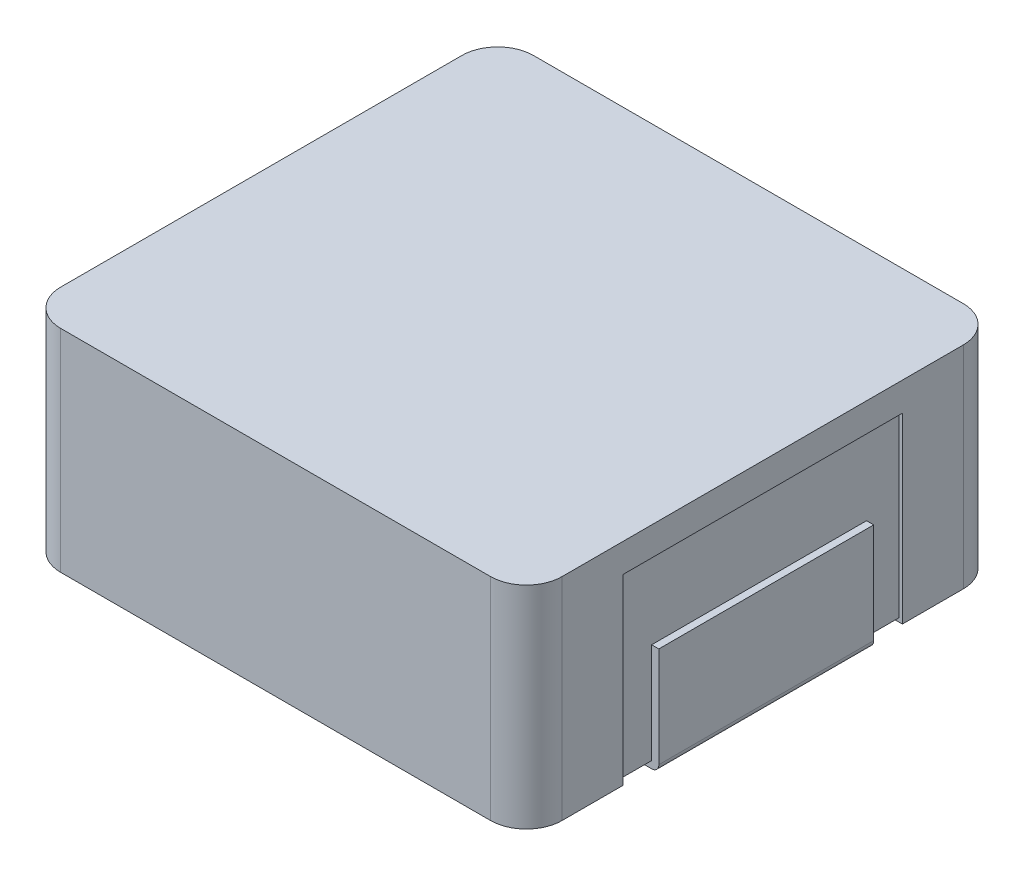
ISO-10303-21;
HEADER;
FILE_DESCRIPTION(('STEP AP214'),'2;1');
FILE_NAME('part.step','',(''),(''),'','','');
FILE_SCHEMA(('AUTOMOTIVE_DESIGN { 1 0 10303 214 1 1 1 1 }'));
ENDSEC;
DATA;
#1=APPLICATION_CONTEXT('core data for automotive mechanical design processes');
#2=APPLICATION_PROTOCOL_DEFINITION('international standard','automotive_design',2000,#1);
#3=PRODUCT_CONTEXT('',#1,'mechanical');
#4=PRODUCT('Part','Part','',(#3));
#5=PRODUCT_RELATED_PRODUCT_CATEGORY('part','',(#4));
#6=PRODUCT_DEFINITION_FORMATION('','',#4);
#7=PRODUCT_DEFINITION_CONTEXT('part definition',#1,'design');
#8=PRODUCT_DEFINITION('design','',#6,#7);
#9=PRODUCT_DEFINITION_SHAPE('','',#8);
#10=(LENGTH_UNIT() NAMED_UNIT(*) SI_UNIT(.MILLI.,.METRE.));
#11=(NAMED_UNIT(*) PLANE_ANGLE_UNIT() SI_UNIT($,.RADIAN.));
#12=(NAMED_UNIT(*) SI_UNIT($,.STERADIAN.) SOLID_ANGLE_UNIT());
#13=UNCERTAINTY_MEASURE_WITH_UNIT(LENGTH_MEASURE(1.E-05),#10,'distance_accuracy_value','');
#14=(GEOMETRIC_REPRESENTATION_CONTEXT(3) GLOBAL_UNCERTAINTY_ASSIGNED_CONTEXT((#13)) GLOBAL_UNIT_ASSIGNED_CONTEXT((#10,
#11,#12)) REPRESENTATION_CONTEXT('',''));
#15=CARTESIAN_POINT('',(0.,0.,0.));
#16=DIRECTION('',(0.,0.,1.));
#17=DIRECTION('',(1.,0.,0.));
#18=AXIS2_PLACEMENT_3D('',#15,#16,#17);
#19=CARTESIAN_POINT('',(-3.45,0.05,1.5));
#20=DIRECTION('',(0.,1.,0.));
#21=DIRECTION('',(-1.,0.,0.));
#22=AXIS2_PLACEMENT_3D('',#19,#20,#21);
#23=PLANE('',#22);
#24=DIRECTION('',(1.,0.,0.));
#25=VECTOR('',#24,1.);
#26=CARTESIAN_POINT('',(-3.45,0.05,-1.5));
#27=LINE('',#26,#25);
#28=CARTESIAN_POINT('',(-3.45,0.05,-1.5));
#29=VERTEX_POINT('',#28);
#30=CARTESIAN_POINT('',(-2.05,0.0500000000000001,-1.5));
#31=VERTEX_POINT('',#30);
#32=EDGE_CURVE('E160',#29,#31,#27,.T.);
#33=ORIENTED_EDGE('',*,*,#32,.F.);
#34=DIRECTION('',(0.,0.,-1.));
#35=VECTOR('',#34,1.);
#36=CARTESIAN_POINT('',(-3.45,0.05,1.5));
#37=LINE('',#36,#35);
#38=CARTESIAN_POINT('',(-3.45,0.05,1.5));
#39=VERTEX_POINT('',#38);
#40=EDGE_CURVE('E12',#39,#29,#37,.T.);
#41=ORIENTED_EDGE('',*,*,#40,.F.);
#42=DIRECTION('',(1.,0.,0.));
#43=VECTOR('',#42,1.);
#44=CARTESIAN_POINT('',(-3.45,0.05,1.5));
#45=LINE('',#44,#43);
#46=CARTESIAN_POINT('',(-2.05,0.0500000000000001,1.5));
#47=VERTEX_POINT('',#46);
#48=EDGE_CURVE('E184',#39,#47,#45,.T.);
#49=ORIENTED_EDGE('',*,*,#48,.T.);
#50=DIRECTION('',(0.,0.,-1.));
#51=VECTOR('',#50,1.);
#52=CARTESIAN_POINT('',(-2.05,0.0500000000000001,1.5));
#53=LINE('',#52,#51);
#54=EDGE_CURVE('E64',#47,#31,#53,.T.);
#55=ORIENTED_EDGE('',*,*,#54,.T.);
#56=EDGE_LOOP('',(#33,#41,#49,#55));
#57=FACE_BOUND('',#56,.T.);
#58=ADVANCED_FACE('F61',(#57),#23,.T.);
#59=CARTESIAN_POINT('',(-3.45,1.45,1.5));
#60=DIRECTION('',(1.,0.,0.));
#61=DIRECTION('',(0.,0.,-1.));
#62=AXIS2_PLACEMENT_3D('',#59,#60,#61);
#63=PLANE('',#62);
#64=DIRECTION('',(0.,-1.,0.));
#65=VECTOR('',#64,1.);
#66=CARTESIAN_POINT('',(-3.45,1.45,-1.5));
#67=LINE('',#66,#65);
#68=CARTESIAN_POINT('',(-3.45,1.45,-1.5));
#69=VERTEX_POINT('',#68);
#70=EDGE_CURVE('E181',#69,#29,#67,.T.);
#71=ORIENTED_EDGE('',*,*,#70,.F.);
#72=DIRECTION('',(0.,0.,-1.));
#73=VECTOR('',#72,1.);
#74=CARTESIAN_POINT('',(-3.45,1.45,1.5));
#75=LINE('',#74,#73);
#76=CARTESIAN_POINT('',(-3.45,1.45,1.5));
#77=VERTEX_POINT('',#76);
#78=EDGE_CURVE('E71',#77,#69,#75,.T.);
#79=ORIENTED_EDGE('',*,*,#78,.F.);
#80=DIRECTION('',(0.,-1.,0.));
#81=VECTOR('',#80,1.);
#82=CARTESIAN_POINT('',(-3.45,1.45,1.5));
#83=LINE('',#82,#81);
#84=EDGE_CURVE('E144',#77,#39,#83,.T.);
#85=ORIENTED_EDGE('',*,*,#84,.T.);
#86=ORIENTED_EDGE('',*,*,#40,.T.);
#87=EDGE_LOOP('',(#71,#79,#85,#86));
#88=FACE_BOUND('',#87,.T.);
#89=ADVANCED_FACE('F198',(#88),#63,.T.);
#90=CARTESIAN_POINT('',(-3.55,1.45,1.5));
#91=DIRECTION('',(0.,1.,0.));
#92=DIRECTION('',(0.,0.,1.));
#93=AXIS2_PLACEMENT_3D('',#90,#91,#92);
#94=PLANE('',#93);
#95=DIRECTION('',(1.,0.,0.));
#96=VECTOR('',#95,1.);
#97=CARTESIAN_POINT('',(-3.55,1.45,-1.5));
#98=LINE('',#97,#96);
#99=CARTESIAN_POINT('',(-3.55,1.45,-1.5));
#100=VERTEX_POINT('',#99);
#101=EDGE_CURVE('E130',#100,#69,#98,.T.);
#102=ORIENTED_EDGE('',*,*,#101,.F.);
#103=DIRECTION('',(0.,0.,-1.));
#104=VECTOR('',#103,1.);
#105=CARTESIAN_POINT('',(-3.55,1.45,1.5));
#106=LINE('',#105,#104);
#107=CARTESIAN_POINT('',(-3.55,1.45,1.5));
#108=VERTEX_POINT('',#107);
#109=EDGE_CURVE('E125',#108,#100,#106,.T.);
#110=ORIENTED_EDGE('',*,*,#109,.F.);
#111=DIRECTION('',(1.,0.,0.));
#112=VECTOR('',#111,1.);
#113=CARTESIAN_POINT('',(-3.55,1.45,1.5));
#114=LINE('',#113,#112);
#115=EDGE_CURVE('E128',#108,#77,#114,.T.);
#116=ORIENTED_EDGE('',*,*,#115,.T.);
#117=ORIENTED_EDGE('',*,*,#78,.T.);
#118=EDGE_LOOP('',(#102,#110,#116,#117));
#119=FACE_BOUND('',#118,.T.);
#120=ADVANCED_FACE('F127',(#119),#94,.T.);
#121=CARTESIAN_POINT('',(-3.55,0.0500000000000009,1.5));
#122=DIRECTION('',(-1.,0.,0.));
#123=DIRECTION('',(0.,-1.,0.));
#124=AXIS2_PLACEMENT_3D('',#121,#122,#123);
#125=PLANE('',#124);
#126=DIRECTION('',(0.,1.,0.));
#127=VECTOR('',#126,1.);
#128=CARTESIAN_POINT('',(-3.55,0.0500000000000009,-1.5));
#129=LINE('',#128,#127);
#130=CARTESIAN_POINT('',(-3.55,0.0500000000000005,-1.5));
#131=VERTEX_POINT('',#130);
#132=EDGE_CURVE('E176',#131,#100,#129,.T.);
#133=ORIENTED_EDGE('',*,*,#132,.F.);
#134=DIRECTION('',(0.,0.,-1.));
#135=VECTOR('',#134,1.);
#136=CARTESIAN_POINT('',(-3.55,0.0500000000000005,1.5));
#137=LINE('',#136,#135);
#138=CARTESIAN_POINT('',(-3.55,0.0500000000000005,1.5));
#139=VERTEX_POINT('',#138);
#140=EDGE_CURVE('E136',#139,#131,#137,.T.);
#141=ORIENTED_EDGE('',*,*,#140,.F.);
#142=DIRECTION('',(0.,1.,0.));
#143=VECTOR('',#142,1.);
#144=CARTESIAN_POINT('',(-3.55,0.0500000000000009,1.5));
#145=LINE('',#144,#143);
#146=EDGE_CURVE('E142',#139,#108,#145,.T.);
#147=ORIENTED_EDGE('',*,*,#146,.T.);
#148=ORIENTED_EDGE('',*,*,#109,.T.);
#149=EDGE_LOOP('',(#133,#141,#147,#148));
#150=FACE_BOUND('',#149,.T.);
#151=ADVANCED_FACE('F147',(#150),#125,.T.);
#152=CARTESIAN_POINT('',(-3.45,0.0500000000000005,1.5));
#153=DIRECTION('',(0.,0.,-1.));
#154=DIRECTION('',(-1.,0.,0.));
#155=AXIS2_PLACEMENT_3D('',#152,#153,#154);
#156=CYLINDRICAL_SURFACE('',#155,0.0999999999999999);
#157=CARTESIAN_POINT('',(-3.45,0.0500000000000005,-1.5));
#158=DIRECTION('',(0.,0.,-1.));
#159=DIRECTION('',(-1.,0.,0.));
#160=AXIS2_PLACEMENT_3D('',#157,#158,#159);
#161=CIRCLE('',#160,0.0999999999999999);
#162=CARTESIAN_POINT('',(-3.45,-0.0499999999999995,-1.5));
#163=VERTEX_POINT('',#162);
#164=EDGE_CURVE('E172',#163,#131,#161,.T.);
#165=ORIENTED_EDGE('',*,*,#164,.F.);
#166=DIRECTION('',(0.,0.,-1.));
#167=VECTOR('',#166,1.);
#168=CARTESIAN_POINT('',(-3.45,-0.0499999999999995,1.5));
#169=LINE('',#168,#167);
#170=CARTESIAN_POINT('',(-3.45,-0.0499999999999995,1.5));
#171=VERTEX_POINT('',#170);
#172=EDGE_CURVE('E190',#171,#163,#169,.T.);
#173=ORIENTED_EDGE('',*,*,#172,.F.);
#174=CARTESIAN_POINT('',(-3.45,0.0500000000000005,1.5));
#175=DIRECTION('',(0.,0.,-1.));
#176=DIRECTION('',(-1.,0.,0.));
#177=AXIS2_PLACEMENT_3D('',#174,#175,#176);
#178=CIRCLE('',#177,0.0999999999999999);
#179=EDGE_CURVE('E149',#171,#139,#178,.T.);
#180=ORIENTED_EDGE('',*,*,#179,.T.);
#181=ORIENTED_EDGE('',*,*,#140,.T.);
#182=EDGE_LOOP('',(#165,#173,#180,#181));
#183=FACE_BOUND('',#182,.T.);
#184=ADVANCED_FACE('F211',(#183),#156,.T.);
#185=CARTESIAN_POINT('',(-2.05,-0.0499999999999999,1.5));
#186=DIRECTION('',(0.,-1.,0.));
#187=DIRECTION('',(1.,0.,0.));
#188=AXIS2_PLACEMENT_3D('',#185,#186,#187);
#189=PLANE('',#188);
#190=DIRECTION('',(-1.,0.,0.));
#191=VECTOR('',#190,1.);
#192=CARTESIAN_POINT('',(-2.05,-0.0499999999999999,-1.5));
#193=LINE('',#192,#191);
#194=CARTESIAN_POINT('',(-2.05,-0.0499999999999999,-1.5));
#195=VERTEX_POINT('',#194);
#196=EDGE_CURVE('E168',#195,#163,#193,.T.);
#197=ORIENTED_EDGE('',*,*,#196,.F.);
#198=DIRECTION('',(0.,0.,-1.));
#199=VECTOR('',#198,1.);
#200=CARTESIAN_POINT('',(-2.05,-0.0499999999999999,1.5));
#201=LINE('',#200,#199);
#202=CARTESIAN_POINT('',(-2.05,-0.0499999999999999,1.5));
#203=VERTEX_POINT('',#202);
#204=EDGE_CURVE('E192',#203,#195,#201,.T.);
#205=ORIENTED_EDGE('',*,*,#204,.F.);
#206=DIRECTION('',(-1.,0.,0.));
#207=VECTOR('',#206,1.);
#208=CARTESIAN_POINT('',(-2.05,-0.0499999999999999,1.5));
#209=LINE('',#208,#207);
#210=EDGE_CURVE('E154',#203,#171,#209,.T.);
#211=ORIENTED_EDGE('',*,*,#210,.T.);
#212=ORIENTED_EDGE('',*,*,#172,.T.);
#213=EDGE_LOOP('',(#197,#205,#211,#212));
#214=FACE_BOUND('',#213,.T.);
#215=ADVANCED_FACE('F214',(#214),#189,.T.);
#216=CARTESIAN_POINT('',(-2.05,0.0500000000000001,1.5));
#217=DIRECTION('',(1.,0.,0.));
#218=DIRECTION('',(0.,0.,-1.));
#219=AXIS2_PLACEMENT_3D('',#216,#217,#218);
#220=PLANE('',#219);
#221=DIRECTION('',(0.,-1.,0.));
#222=VECTOR('',#221,1.);
#223=CARTESIAN_POINT('',(-2.05,0.0500000000000001,-1.5));
#224=LINE('',#223,#222);
#225=EDGE_CURVE('E164',#31,#195,#224,.T.);
#226=ORIENTED_EDGE('',*,*,#225,.F.);
#227=ORIENTED_EDGE('',*,*,#54,.F.);
#228=DIRECTION('',(0.,-1.,0.));
#229=VECTOR('',#228,1.);
#230=CARTESIAN_POINT('',(-2.05,0.0500000000000001,1.5));
#231=LINE('',#230,#229);
#232=EDGE_CURVE('E322',#47,#203,#231,.T.);
#233=ORIENTED_EDGE('',*,*,#232,.T.);
#234=ORIENTED_EDGE('',*,*,#204,.T.);
#235=EDGE_LOOP('',(#226,#227,#233,#234));
#236=FACE_BOUND('',#235,.T.);
#237=ADVANCED_FACE('F195',(#236),#220,.T.);
#238=CARTESIAN_POINT('',(-3.45,0.0500000000000005,1.5));
#239=DIRECTION('',(0.,0.,-1.));
#240=DIRECTION('',(-1.,0.,0.));
#241=AXIS2_PLACEMENT_3D('',#238,#239,#240);
#242=PLANE('',#241);
#243=ORIENTED_EDGE('',*,*,#48,.F.);
#244=ORIENTED_EDGE('',*,*,#84,.F.);
#245=ORIENTED_EDGE('',*,*,#115,.F.);
#246=ORIENTED_EDGE('',*,*,#146,.F.);
#247=ORIENTED_EDGE('',*,*,#179,.F.);
#248=ORIENTED_EDGE('',*,*,#210,.F.);
#249=ORIENTED_EDGE('',*,*,#232,.F.);
#250=EDGE_LOOP('',(#243,#244,#245,#246,#247,#248,#249));
#251=FACE_BOUND('',#250,.T.);
#252=ADVANCED_FACE('F140',(#251),#242,.F.);
#253=CARTESIAN_POINT('',(-3.45,0.0500000000000005,-1.5));
#254=DIRECTION('',(0.,0.,-1.));
#255=DIRECTION('',(-1.,0.,0.));
#256=AXIS2_PLACEMENT_3D('',#253,#254,#255);
#257=PLANE('',#256);
#258=ORIENTED_EDGE('',*,*,#32,.T.);
#259=ORIENTED_EDGE('',*,*,#225,.T.);
#260=ORIENTED_EDGE('',*,*,#196,.T.);
#261=ORIENTED_EDGE('',*,*,#164,.T.);
#262=ORIENTED_EDGE('',*,*,#132,.T.);
#263=ORIENTED_EDGE('',*,*,#101,.T.);
#264=ORIENTED_EDGE('',*,*,#70,.T.);
#265=EDGE_LOOP('',(#258,#259,#260,#261,#262,#263,#264));
#266=FACE_BOUND('',#265,.T.);
#267=ADVANCED_FACE('F197',(#266),#257,.T.);
#268=CLOSED_SHELL('',(#58,#89,#120,#151,#184,#215,#237,#252,#267));
#269=MANIFOLD_SOLID_BREP('B2',#268);
#270=CARTESIAN_POINT('',(0.,0.05,0.));
#271=DIRECTION('',(0.,1.,0.));
#272=DIRECTION('',(0.,0.,1.));
#273=AXIS2_PLACEMENT_3D('',#270,#271,#272);
#274=PLANE('',#273);
#275=DIRECTION('',(-1.,0.,0.));
#276=VECTOR('',#275,1.);
#277=CARTESIAN_POINT('',(3.45,0.05,1.5));
#278=LINE('',#277,#276);
#279=CARTESIAN_POINT('',(3.45,0.05,1.5));
#280=VERTEX_POINT('',#279);
#281=CARTESIAN_POINT('',(2.05,0.0500000000000001,1.5));
#282=VERTEX_POINT('',#281);
#283=EDGE_CURVE('E512',#280,#282,#278,.T.);
#284=ORIENTED_EDGE('',*,*,#283,.F.);
#285=DIRECTION('',(0.,0.,1.));
#286=VECTOR('',#285,1.);
#287=CARTESIAN_POINT('',(3.45,0.05,0.));
#288=LINE('',#287,#286);
#289=CARTESIAN_POINT('',(3.45,0.05,1.95));
#290=VERTEX_POINT('',#289);
#291=EDGE_CURVE('E338',#280,#290,#288,.T.);
#292=ORIENTED_EDGE('',*,*,#291,.T.);
#293=DIRECTION('',(-1.,0.,0.));
#294=VECTOR('',#293,1.);
#295=CARTESIAN_POINT('',(3.5,0.05,1.95));
#296=LINE('',#295,#294);
#297=CARTESIAN_POINT('',(0.949999999999999,0.05,1.95));
#298=VERTEX_POINT('',#297);
#299=EDGE_CURVE('E681',#290,#298,#296,.T.);
#300=ORIENTED_EDGE('',*,*,#299,.T.);
#301=DIRECTION('',(0.,0.,-1.));
#302=VECTOR('',#301,1.);
#303=CARTESIAN_POINT('',(0.949999999999999,0.05,1.95));
#304=LINE('',#303,#302);
#305=CARTESIAN_POINT('',(0.949999999999999,0.05,-1.95));
#306=VERTEX_POINT('',#305);
#307=EDGE_CURVE('E691',#298,#306,#304,.T.);
#308=ORIENTED_EDGE('',*,*,#307,.T.);
#309=DIRECTION('',(1.,0.,0.));
#310=VECTOR('',#309,1.);
#311=CARTESIAN_POINT('',(3.5,0.05,-1.95));
#312=LINE('',#311,#310);
#313=CARTESIAN_POINT('',(3.45,0.05,-1.95));
#314=VERTEX_POINT('',#313);
#315=EDGE_CURVE('E669',#306,#314,#312,.T.);
#316=ORIENTED_EDGE('',*,*,#315,.T.);
#317=CARTESIAN_POINT('',(3.45,0.05,-1.5));
#318=VERTEX_POINT('',#317);
#319=EDGE_CURVE('E59',#314,#318,#288,.T.);
#320=ORIENTED_EDGE('',*,*,#319,.T.);
#321=DIRECTION('',(-1.,0.,0.));
#322=VECTOR('',#321,1.);
#323=CARTESIAN_POINT('',(3.45,0.05,-1.5));
#324=LINE('',#323,#322);
#325=CARTESIAN_POINT('',(2.05,0.0500000000000001,-1.5));
#326=VERTEX_POINT('',#325);
#327=EDGE_CURVE('E345',#318,#326,#324,.T.);
#328=ORIENTED_EDGE('',*,*,#327,.T.);
#329=DIRECTION('',(0.,0.,-1.));
#330=VECTOR('',#329,1.);
#331=CARTESIAN_POINT('',(2.05,0.0500000000000001,1.5));
#332=LINE('',#331,#330);
#333=EDGE_CURVE('E524',#282,#326,#332,.T.);
#334=ORIENTED_EDGE('',*,*,#333,.F.);
#335=EDGE_LOOP('',(#284,#292,#300,#308,#316,#320,#328,#334));
#336=FACE_BOUND('',#335,.T.);
#337=ADVANCED_FACE('F329',(#336),#274,.F.);
#338=CARTESIAN_POINT('',(3.45,0.,0.));
#339=DIRECTION('',(-1.,0.,0.));
#340=DIRECTION('',(0.,0.,-1.));
#341=AXIS2_PLACEMENT_3D('',#338,#339,#340);
#342=PLANE('',#341);
#343=DIRECTION('',(0.,-1.,0.));
#344=VECTOR('',#343,1.);
#345=CARTESIAN_POINT('',(3.45,1.45,1.5));
#346=LINE('',#345,#344);
#347=CARTESIAN_POINT('',(3.45,1.45,1.5));
#348=VERTEX_POINT('',#347);
#349=EDGE_CURVE('E510',#348,#280,#346,.T.);
#350=ORIENTED_EDGE('',*,*,#349,.F.);
#351=DIRECTION('',(0.,0.,-1.));
#352=VECTOR('',#351,1.);
#353=CARTESIAN_POINT('',(3.45,1.45,1.5));
#354=LINE('',#353,#352);
#355=CARTESIAN_POINT('',(3.45,1.45,-1.5));
#356=VERTEX_POINT('',#355);
#357=EDGE_CURVE('E521',#348,#356,#354,.T.);
#358=ORIENTED_EDGE('',*,*,#357,.T.);
#359=DIRECTION('',(0.,-1.,0.));
#360=VECTOR('',#359,1.);
#361=CARTESIAN_POINT('',(3.45,1.45,-1.5));
#362=LINE('',#361,#360);
#363=EDGE_CURVE('E783',#356,#318,#362,.T.);
#364=ORIENTED_EDGE('',*,*,#363,.T.);
#365=ORIENTED_EDGE('',*,*,#319,.F.);
#366=DIRECTION('',(0.,-1.,0.));
#367=VECTOR('',#366,1.);
#368=CARTESIAN_POINT('',(3.45,0.,-1.95));
#369=LINE('',#368,#367);
#370=CARTESIAN_POINT('',(3.45,2.55,-1.95));
#371=VERTEX_POINT('',#370);
#372=EDGE_CURVE('E730',#371,#314,#369,.T.);
#373=ORIENTED_EDGE('',*,*,#372,.F.);
#374=DIRECTION('',(0.,0.,-1.));
#375=VECTOR('',#374,1.);
#376=CARTESIAN_POINT('',(3.45,2.55,-1.95));
#377=LINE('',#376,#375);
#378=CARTESIAN_POINT('',(3.45,2.55,1.95));
#379=VERTEX_POINT('',#378);
#380=EDGE_CURVE('E734',#379,#371,#377,.T.);
#381=ORIENTED_EDGE('',*,*,#380,.F.);
#382=DIRECTION('',(0.,1.,0.));
#383=VECTOR('',#382,1.);
#384=CARTESIAN_POINT('',(3.45,0.,1.95));
#385=LINE('',#384,#383);
#386=EDGE_CURVE('E529',#290,#379,#385,.T.);
#387=ORIENTED_EDGE('',*,*,#386,.F.);
#388=ORIENTED_EDGE('',*,*,#291,.F.);
#389=EDGE_LOOP('',(#350,#358,#364,#365,#373,#381,#387,#388));
#390=FACE_BOUND('',#389,.T.);
#391=ADVANCED_FACE('F527',(#390),#342,.F.);
#392=CARTESIAN_POINT('',(3.5,2.95,2.8));
#393=DIRECTION('',(-1.,0.,0.));
#394=DIRECTION('',(0.,0.,1.));
#395=AXIS2_PLACEMENT_3D('',#392,#393,#394);
#396=PLANE('',#395);
#397=DIRECTION('',(0.,0.,-1.));
#398=VECTOR('',#397,1.);
#399=CARTESIAN_POINT('',(3.5,2.55,-1.95));
#400=LINE('',#399,#398);
#401=CARTESIAN_POINT('',(3.5,2.55,1.95));
#402=VERTEX_POINT('',#401);
#403=CARTESIAN_POINT('',(3.5,2.55,-1.95));
#404=VERTEX_POINT('',#403);
#405=EDGE_CURVE('E726',#402,#404,#400,.T.);
#406=ORIENTED_EDGE('',*,*,#405,.T.);
#407=DIRECTION('',(0.,-1.,0.));
#408=VECTOR('',#407,1.);
#409=CARTESIAN_POINT('',(3.5,0.05,-1.95));
#410=LINE('',#409,#408);
#411=CARTESIAN_POINT('',(3.5,0.,-1.95));
#412=VERTEX_POINT('',#411);
#413=EDGE_CURVE('E605',#404,#412,#410,.T.);
#414=ORIENTED_EDGE('',*,*,#413,.T.);
#415=DIRECTION('',(0.,0.,-1.));
#416=VECTOR('',#415,1.);
#417=CARTESIAN_POINT('',(3.5,0.,2.8));
#418=LINE('',#417,#416);
#419=CARTESIAN_POINT('',(3.5,0.,-2.8));
#420=VERTEX_POINT('',#419);
#421=EDGE_CURVE('E594',#412,#420,#418,.T.);
#422=ORIENTED_EDGE('',*,*,#421,.T.);
#423=DIRECTION('',(0.,-1.,0.));
#424=VECTOR('',#423,1.);
#425=CARTESIAN_POINT('',(3.5,2.95,-2.8));
#426=LINE('',#425,#424);
#427=CARTESIAN_POINT('',(3.5,2.95,-2.8));
#428=VERTEX_POINT('',#427);
#429=EDGE_CURVE('E554',#428,#420,#426,.T.);
#430=ORIENTED_EDGE('',*,*,#429,.F.);
#431=DIRECTION('',(0.,0.,-1.));
#432=VECTOR('',#431,1.);
#433=CARTESIAN_POINT('',(3.5,2.95,2.8));
#434=LINE('',#433,#432);
#435=CARTESIAN_POINT('',(3.5,2.95,2.8));
#436=VERTEX_POINT('',#435);
#437=EDGE_CURVE('E617',#436,#428,#434,.T.);
#438=ORIENTED_EDGE('',*,*,#437,.F.);
#439=DIRECTION('',(0.,-1.,0.));
#440=VECTOR('',#439,1.);
#441=CARTESIAN_POINT('',(3.5,2.95,2.8));
#442=LINE('',#441,#440);
#443=CARTESIAN_POINT('',(3.5,0.,2.8));
#444=VERTEX_POINT('',#443);
#445=EDGE_CURVE('E550',#436,#444,#442,.T.);
#446=ORIENTED_EDGE('',*,*,#445,.T.);
#447=CARTESIAN_POINT('',(3.5,0.,1.95));
#448=VERTEX_POINT('',#447);
#449=EDGE_CURVE('E590',#444,#448,#418,.T.);
#450=ORIENTED_EDGE('',*,*,#449,.T.);
#451=DIRECTION('',(0.,-1.,0.));
#452=VECTOR('',#451,1.);
#453=CARTESIAN_POINT('',(3.5,0.05,1.95));
#454=LINE('',#453,#452);
#455=EDGE_CURVE('E665',#402,#448,#454,.T.);
#456=ORIENTED_EDGE('',*,*,#455,.F.);
#457=EDGE_LOOP('',(#406,#414,#422,#430,#438,#446,#450,#456));
#458=FACE_BOUND('',#457,.T.);
#459=ADVANCED_FACE('F799',(#458),#396,.F.);
#460=CARTESIAN_POINT('',(-3.,2.95,2.8));
#461=DIRECTION('',(0.,-1.,0.));
#462=DIRECTION('',(0.,0.,-1.));
#463=AXIS2_PLACEMENT_3D('',#460,#461,#462);
#464=CYLINDRICAL_SURFACE('',#463,0.5);
#465=CARTESIAN_POINT('',(-3.,0.,2.8));
#466=DIRECTION('',(0.,1.,0.));
#467=DIRECTION('',(0.,0.,-1.));
#468=AXIS2_PLACEMENT_3D('',#465,#466,#467);
#469=CIRCLE('',#468,0.5);
#470=CARTESIAN_POINT('',(-3.5,0.,2.8));
#471=VERTEX_POINT('',#470);
#472=CARTESIAN_POINT('',(-3.,0.,3.3));
#473=VERTEX_POINT('',#472);
#474=EDGE_CURVE('E601',#471,#473,#469,.T.);
#475=ORIENTED_EDGE('',*,*,#474,.T.);
#476=DIRECTION('',(0.,-1.,0.));
#477=VECTOR('',#476,1.);
#478=CARTESIAN_POINT('',(-3.,2.95,3.3));
#479=LINE('',#478,#477);
#480=CARTESIAN_POINT('',(-3.,2.95,3.3));
#481=VERTEX_POINT('',#480);
#482=EDGE_CURVE('E536',#481,#473,#479,.T.);
#483=ORIENTED_EDGE('',*,*,#482,.F.);
#484=CARTESIAN_POINT('',(-3.,2.95,2.8));
#485=DIRECTION('',(0.,1.,0.));
#486=DIRECTION('',(0.,0.,-1.));
#487=AXIS2_PLACEMENT_3D('',#484,#485,#486);
#488=CIRCLE('',#487,0.5);
#489=CARTESIAN_POINT('',(-3.5,2.95,2.8));
#490=VERTEX_POINT('',#489);
#491=EDGE_CURVE('E579',#490,#481,#488,.T.);
#492=ORIENTED_EDGE('',*,*,#491,.F.);
#493=DIRECTION('',(0.,-1.,0.));
#494=VECTOR('',#493,1.);
#495=CARTESIAN_POINT('',(-3.5,2.95,2.8));
#496=LINE('',#495,#494);
#497=EDGE_CURVE('E570',#490,#471,#496,.T.);
#498=ORIENTED_EDGE('',*,*,#497,.T.);
#499=EDGE_LOOP('',(#475,#483,#492,#498));
#500=FACE_BOUND('',#499,.T.);
#501=ADVANCED_FACE('F331',(#500),#464,.T.);
#502=CARTESIAN_POINT('',(-3.,2.95,3.3));
#503=DIRECTION('',(0.,0.,-1.));
#504=DIRECTION('',(-1.,0.,0.));
#505=AXIS2_PLACEMENT_3D('',#502,#503,#504);
#506=PLANE('',#505);
#507=DIRECTION('',(1.,0.,0.));
#508=VECTOR('',#507,1.);
#509=CARTESIAN_POINT('',(-3.,0.,3.3));
#510=LINE('',#509,#508);
#511=CARTESIAN_POINT('',(3.,0.,3.3));
#512=VERTEX_POINT('',#511);
#513=EDGE_CURVE('E598',#473,#512,#510,.T.);
#514=ORIENTED_EDGE('',*,*,#513,.T.);
#515=DIRECTION('',(0.,-1.,0.));
#516=VECTOR('',#515,1.);
#517=CARTESIAN_POINT('',(3.,2.95,3.3));
#518=LINE('',#517,#516);
#519=CARTESIAN_POINT('',(3.,2.95,3.3));
#520=VERTEX_POINT('',#519);
#521=EDGE_CURVE('E544',#520,#512,#518,.T.);
#522=ORIENTED_EDGE('',*,*,#521,.F.);
#523=DIRECTION('',(1.,0.,0.));
#524=VECTOR('',#523,1.);
#525=CARTESIAN_POINT('',(-3.,2.95,3.3));
#526=LINE('',#525,#524);
#527=EDGE_CURVE('E623',#481,#520,#526,.T.);
#528=ORIENTED_EDGE('',*,*,#527,.F.);
#529=ORIENTED_EDGE('',*,*,#482,.T.);
#530=EDGE_LOOP('',(#514,#522,#528,#529));
#531=FACE_BOUND('',#530,.T.);
#532=ADVANCED_FACE('F834',(#531),#506,.F.);
#533=CARTESIAN_POINT('',(3.,2.95,2.8));
#534=DIRECTION('',(0.,-1.,0.));
#535=DIRECTION('',(0.,0.,-1.));
#536=AXIS2_PLACEMENT_3D('',#533,#534,#535);
#537=CYLINDRICAL_SURFACE('',#536,0.5);
#538=CARTESIAN_POINT('',(3.,0.,2.8));
#539=DIRECTION('',(0.,1.,0.));
#540=DIRECTION('',(0.,0.,1.));
#541=AXIS2_PLACEMENT_3D('',#538,#539,#540);
#542=CIRCLE('',#541,0.5);
#543=EDGE_CURVE('E595',#512,#444,#542,.T.);
#544=ORIENTED_EDGE('',*,*,#543,.T.);
#545=ORIENTED_EDGE('',*,*,#445,.F.);
#546=CARTESIAN_POINT('',(3.,2.95,2.8));
#547=DIRECTION('',(0.,1.,0.));
#548=DIRECTION('',(0.,0.,1.));
#549=AXIS2_PLACEMENT_3D('',#546,#547,#548);
#550=CIRCLE('',#549,0.5);
#551=EDGE_CURVE('E620',#520,#436,#550,.T.);
#552=ORIENTED_EDGE('',*,*,#551,.F.);
#553=ORIENTED_EDGE('',*,*,#521,.T.);
#554=EDGE_LOOP('',(#544,#545,#552,#553));
#555=FACE_BOUND('',#554,.T.);
#556=ADVANCED_FACE('F831',(#555),#537,.T.);
#557=CARTESIAN_POINT('',(3.,2.95,-2.8));
#558=DIRECTION('',(0.,-1.,0.));
#559=DIRECTION('',(0.,0.,-1.));
#560=AXIS2_PLACEMENT_3D('',#557,#558,#559);
#561=CYLINDRICAL_SURFACE('',#560,0.5);
#562=CARTESIAN_POINT('',(3.,0.,-2.8));
#563=DIRECTION('',(0.,1.,0.));
#564=DIRECTION('',(0.,0.,-1.));
#565=AXIS2_PLACEMENT_3D('',#562,#563,#564);
#566=CIRCLE('',#565,0.5);
#567=CARTESIAN_POINT('',(3.,0.,-3.3));
#568=VERTEX_POINT('',#567);
#569=EDGE_CURVE('E587',#420,#568,#566,.T.);
#570=ORIENTED_EDGE('',*,*,#569,.T.);
#571=DIRECTION('',(0.,-1.,0.));
#572=VECTOR('',#571,1.);
#573=CARTESIAN_POINT('',(3.,2.95,-3.3));
#574=LINE('',#573,#572);
#575=CARTESIAN_POINT('',(3.,2.95,-3.3));
#576=VERTEX_POINT('',#575);
#577=EDGE_CURVE('E558',#576,#568,#574,.T.);
#578=ORIENTED_EDGE('',*,*,#577,.F.);
#579=CARTESIAN_POINT('',(3.,2.95,-2.8));
#580=DIRECTION('',(0.,1.,0.));
#581=DIRECTION('',(0.,0.,-1.));
#582=AXIS2_PLACEMENT_3D('',#579,#580,#581);
#583=CIRCLE('',#582,0.5);
#584=EDGE_CURVE('E614',#428,#576,#583,.T.);
#585=ORIENTED_EDGE('',*,*,#584,.F.);
#586=ORIENTED_EDGE('',*,*,#429,.T.);
#587=EDGE_LOOP('',(#570,#578,#585,#586));
#588=FACE_BOUND('',#587,.T.);
#589=ADVANCED_FACE('F820',(#588),#561,.T.);
#590=CARTESIAN_POINT('',(-3.,2.95,-3.3));
#591=DIRECTION('',(0.,0.,1.));
#592=DIRECTION('',(1.,0.,0.));
#593=AXIS2_PLACEMENT_3D('',#590,#591,#592);
#594=PLANE('',#593);
#595=DIRECTION('',(-1.,0.,0.));
#596=VECTOR('',#595,1.);
#597=CARTESIAN_POINT('',(-3.,0.,-3.3));
#598=LINE('',#597,#596);
#599=CARTESIAN_POINT('',(-3.,0.,-3.3));
#600=VERTEX_POINT('',#599);
#601=EDGE_CURVE('E584',#568,#600,#598,.T.);
#602=ORIENTED_EDGE('',*,*,#601,.T.);
#603=DIRECTION('',(0.,-1.,0.));
#604=VECTOR('',#603,1.);
#605=CARTESIAN_POINT('',(-3.,2.95,-3.3));
#606=LINE('',#605,#604);
#607=CARTESIAN_POINT('',(-3.,2.95,-3.3));
#608=VERTEX_POINT('',#607);
#609=EDGE_CURVE('E562',#608,#600,#606,.T.);
#610=ORIENTED_EDGE('',*,*,#609,.F.);
#611=DIRECTION('',(-1.,0.,0.));
#612=VECTOR('',#611,1.);
#613=CARTESIAN_POINT('',(-3.,2.95,-3.3));
#614=LINE('',#613,#612);
#615=EDGE_CURVE('E611',#576,#608,#614,.T.);
#616=ORIENTED_EDGE('',*,*,#615,.F.);
#617=ORIENTED_EDGE('',*,*,#577,.T.);
#618=EDGE_LOOP('',(#602,#610,#616,#617));
#619=FACE_BOUND('',#618,.T.);
#620=ADVANCED_FACE('F872',(#619),#594,.F.);
#621=CARTESIAN_POINT('',(-3.,2.95,-2.8));
#622=DIRECTION('',(0.,-1.,0.));
#623=DIRECTION('',(0.,0.,-1.));
#624=AXIS2_PLACEMENT_3D('',#621,#622,#623);
#625=CYLINDRICAL_SURFACE('',#624,0.5);
#626=CARTESIAN_POINT('',(-3.,0.,-2.8));
#627=DIRECTION('',(0.,1.,0.));
#628=DIRECTION('',(0.,0.,-1.));
#629=AXIS2_PLACEMENT_3D('',#626,#627,#628);
#630=CIRCLE('',#629,0.5);
#631=CARTESIAN_POINT('',(-3.5,0.,-2.8));
#632=VERTEX_POINT('',#631);
#633=EDGE_CURVE('E581',#600,#632,#630,.T.);
#634=ORIENTED_EDGE('',*,*,#633,.T.);
#635=DIRECTION('',(0.,-1.,0.));
#636=VECTOR('',#635,1.);
#637=CARTESIAN_POINT('',(-3.5,2.95,-2.8));
#638=LINE('',#637,#636);
#639=CARTESIAN_POINT('',(-3.5,2.95,-2.8));
#640=VERTEX_POINT('',#639);
#641=EDGE_CURVE('E566',#640,#632,#638,.T.);
#642=ORIENTED_EDGE('',*,*,#641,.F.);
#643=CARTESIAN_POINT('',(-3.,2.95,-2.8));
#644=DIRECTION('',(0.,1.,0.));
#645=DIRECTION('',(0.,0.,-1.));
#646=AXIS2_PLACEMENT_3D('',#643,#644,#645);
#647=CIRCLE('',#646,0.5);
#648=EDGE_CURVE('E608',#608,#640,#647,.T.);
#649=ORIENTED_EDGE('',*,*,#648,.F.);
#650=ORIENTED_EDGE('',*,*,#609,.T.);
#651=EDGE_LOOP('',(#634,#642,#649,#650));
#652=FACE_BOUND('',#651,.T.);
#653=ADVANCED_FACE('F870',(#652),#625,.T.);
#654=CARTESIAN_POINT('',(-3.5,2.95,2.8));
#655=DIRECTION('',(1.,0.,0.));
#656=DIRECTION('',(0.,0.,-1.));
#657=AXIS2_PLACEMENT_3D('',#654,#655,#656);
#658=PLANE('',#657);
#659=DIRECTION('',(0.,-1.,0.));
#660=VECTOR('',#659,1.);
#661=CARTESIAN_POINT('',(-3.5,0.05,-1.95));
#662=LINE('',#661,#660);
#663=CARTESIAN_POINT('',(-3.5,2.55,-1.95));
#664=VERTEX_POINT('',#663);
#665=CARTESIAN_POINT('',(-3.5,0.,-1.95));
#666=VERTEX_POINT('',#665);
#667=EDGE_CURVE('E641',#664,#666,#662,.T.);
#668=ORIENTED_EDGE('',*,*,#667,.F.);
#669=DIRECTION('',(0.,0.,-1.));
#670=VECTOR('',#669,1.);
#671=CARTESIAN_POINT('',(-3.5,2.55,-1.95));
#672=LINE('',#671,#670);
#673=CARTESIAN_POINT('',(-3.5,2.55,1.95));
#674=VERTEX_POINT('',#673);
#675=EDGE_CURVE('E705',#674,#664,#672,.T.);
#676=ORIENTED_EDGE('',*,*,#675,.F.);
#677=DIRECTION('',(0.,-1.,0.));
#678=VECTOR('',#677,1.);
#679=CARTESIAN_POINT('',(-3.5,0.05,1.95));
#680=LINE('',#679,#678);
#681=CARTESIAN_POINT('',(-3.5,0.,1.95));
#682=VERTEX_POINT('',#681);
#683=EDGE_CURVE('E652',#674,#682,#680,.T.);
#684=ORIENTED_EDGE('',*,*,#683,.T.);
#685=DIRECTION('',(0.,0.,1.));
#686=VECTOR('',#685,1.);
#687=CARTESIAN_POINT('',(-3.5,0.,2.8));
#688=LINE('',#687,#686);
#689=EDGE_CURVE('E580',#682,#471,#688,.T.);
#690=ORIENTED_EDGE('',*,*,#689,.T.);
#691=ORIENTED_EDGE('',*,*,#497,.F.);
#692=DIRECTION('',(0.,0.,1.));
#693=VECTOR('',#692,1.);
#694=CARTESIAN_POINT('',(-3.5,2.95,2.8));
#695=LINE('',#694,#693);
#696=EDGE_CURVE('E574',#640,#490,#695,.T.);
#697=ORIENTED_EDGE('',*,*,#696,.F.);
#698=ORIENTED_EDGE('',*,*,#641,.T.);
#699=EDGE_CURVE('E575',#632,#666,#688,.T.);
#700=ORIENTED_EDGE('',*,*,#699,.T.);
#701=EDGE_LOOP('',(#668,#676,#684,#690,#691,#697,#698,#700));
#702=FACE_BOUND('',#701,.T.);
#703=ADVANCED_FACE('F844',(#702),#658,.F.);
#704=CARTESIAN_POINT('',(-3.,2.95,2.8));
#705=DIRECTION('',(0.,-1.,0.));
#706=DIRECTION('',(0.,0.,-1.));
#707=AXIS2_PLACEMENT_3D('',#704,#705,#706);
#708=PLANE('',#707);
#709=ORIENTED_EDGE('',*,*,#491,.T.);
#710=ORIENTED_EDGE('',*,*,#527,.T.);
#711=ORIENTED_EDGE('',*,*,#551,.T.);
#712=ORIENTED_EDGE('',*,*,#437,.T.);
#713=ORIENTED_EDGE('',*,*,#584,.T.);
#714=ORIENTED_EDGE('',*,*,#615,.T.);
#715=ORIENTED_EDGE('',*,*,#648,.T.);
#716=ORIENTED_EDGE('',*,*,#696,.T.);
#717=EDGE_LOOP('',(#709,#710,#711,#712,#713,#714,#715,#716));
#718=FACE_BOUND('',#717,.T.);
#719=ADVANCED_FACE('F824',(#718),#708,.F.);
#720=CARTESIAN_POINT('',(-3.,0.,2.8));
#721=DIRECTION('',(0.,-1.,0.));
#722=DIRECTION('',(0.,0.,-1.));
#723=AXIS2_PLACEMENT_3D('',#720,#721,#722);
#724=PLANE('',#723);
#725=DIRECTION('',(1.,0.,0.));
#726=VECTOR('',#725,1.);
#727=CARTESIAN_POINT('',(3.5,0.,-1.95));
#728=LINE('',#727,#726);
#729=CARTESIAN_POINT('',(0.949999999999999,0.,-1.95));
#730=VERTEX_POINT('',#729);
#731=EDGE_CURVE('E678',#730,#412,#728,.T.);
#732=ORIENTED_EDGE('',*,*,#731,.F.);
#733=DIRECTION('',(0.,0.,-1.));
#734=VECTOR('',#733,1.);
#735=CARTESIAN_POINT('',(0.949999999999999,0.,1.95));
#736=LINE('',#735,#734);
#737=CARTESIAN_POINT('',(0.949999999999999,0.,1.95));
#738=VERTEX_POINT('',#737);
#739=EDGE_CURVE('E682',#738,#730,#736,.T.);
#740=ORIENTED_EDGE('',*,*,#739,.F.);
#741=DIRECTION('',(-1.,0.,0.));
#742=VECTOR('',#741,1.);
#743=CARTESIAN_POINT('',(3.5,0.,1.95));
#744=LINE('',#743,#742);
#745=EDGE_CURVE('E645',#448,#738,#744,.T.);
#746=ORIENTED_EDGE('',*,*,#745,.F.);
#747=ORIENTED_EDGE('',*,*,#449,.F.);
#748=ORIENTED_EDGE('',*,*,#543,.F.);
#749=ORIENTED_EDGE('',*,*,#513,.F.);
#750=ORIENTED_EDGE('',*,*,#474,.F.);
#751=ORIENTED_EDGE('',*,*,#689,.F.);
#752=DIRECTION('',(-1.,0.,0.));
#753=VECTOR('',#752,1.);
#754=CARTESIAN_POINT('',(-3.5,0.,1.95));
#755=LINE('',#754,#753);
#756=CARTESIAN_POINT('',(-0.950000000000001,0.,1.95));
#757=VERTEX_POINT('',#756);
#758=EDGE_CURVE('E632',#757,#682,#755,.T.);
#759=ORIENTED_EDGE('',*,*,#758,.F.);
#760=DIRECTION('',(0.,0.,1.));
#761=VECTOR('',#760,1.);
#762=CARTESIAN_POINT('',(-0.950000000000001,0.,1.95));
#763=LINE('',#762,#761);
#764=CARTESIAN_POINT('',(-0.950000000000001,0.,-1.95));
#765=VERTEX_POINT('',#764);
#766=EDGE_CURVE('E646',#765,#757,#763,.T.);
#767=ORIENTED_EDGE('',*,*,#766,.F.);
#768=DIRECTION('',(1.,0.,0.));
#769=VECTOR('',#768,1.);
#770=CARTESIAN_POINT('',(-3.5,0.,-1.95));
#771=LINE('',#770,#769);
#772=EDGE_CURVE('E642',#666,#765,#771,.T.);
#773=ORIENTED_EDGE('',*,*,#772,.F.);
#774=ORIENTED_EDGE('',*,*,#699,.F.);
#775=ORIENTED_EDGE('',*,*,#633,.F.);
#776=ORIENTED_EDGE('',*,*,#601,.F.);
#777=ORIENTED_EDGE('',*,*,#569,.F.);
#778=ORIENTED_EDGE('',*,*,#421,.F.);
#779=EDGE_LOOP('',(#732,#740,#746,#747,#748,#749,#750,#751,#759,#767,#773,#774,#775,#776,#777,#778));
#780=FACE_BOUND('',#779,.T.);
#781=ADVANCED_FACE('F812',(#780),#724,.T.);
#782=CARTESIAN_POINT('',(-3.5,0.05,1.95));
#783=DIRECTION('',(0.,0.,1.));
#784=DIRECTION('',(1.,0.,0.));
#785=AXIS2_PLACEMENT_3D('',#782,#783,#784);
#786=PLANE('',#785);
#787=ORIENTED_EDGE('',*,*,#758,.T.);
#788=ORIENTED_EDGE('',*,*,#683,.F.);
#789=DIRECTION('',(-1.,0.,0.));
#790=VECTOR('',#789,1.);
#791=CARTESIAN_POINT('',(-3.45,2.55,1.95));
#792=LINE('',#791,#790);
#793=CARTESIAN_POINT('',(-3.45,2.55,1.95));
#794=VERTEX_POINT('',#793);
#795=EDGE_CURVE('E697',#794,#674,#792,.T.);
#796=ORIENTED_EDGE('',*,*,#795,.F.);
#797=DIRECTION('',(0.,1.,0.));
#798=VECTOR('',#797,1.);
#799=CARTESIAN_POINT('',(-3.45,0.,1.95));
#800=LINE('',#799,#798);
#801=CARTESIAN_POINT('',(-3.45,0.05,1.95));
#802=VERTEX_POINT('',#801);
#803=EDGE_CURVE('E714',#802,#794,#800,.T.);
#804=ORIENTED_EDGE('',*,*,#803,.F.);
#805=DIRECTION('',(-1.,0.,0.));
#806=VECTOR('',#805,1.);
#807=CARTESIAN_POINT('',(-3.5,0.05,1.95));
#808=LINE('',#807,#806);
#809=CARTESIAN_POINT('',(-0.950000000000001,0.05,1.95));
#810=VERTEX_POINT('',#809);
#811=EDGE_CURVE('E637',#810,#802,#808,.T.);
#812=ORIENTED_EDGE('',*,*,#811,.F.);
#813=DIRECTION('',(0.,-1.,0.));
#814=VECTOR('',#813,1.);
#815=CARTESIAN_POINT('',(-0.950000000000001,0.05,1.95));
#816=LINE('',#815,#814);
#817=EDGE_CURVE('E655',#810,#757,#816,.T.);
#818=ORIENTED_EDGE('',*,*,#817,.T.);
#819=EDGE_LOOP('',(#787,#788,#796,#804,#812,#818));
#820=FACE_BOUND('',#819,.T.);
#821=ADVANCED_FACE('F849',(#820),#786,.F.);
#822=CARTESIAN_POINT('',(-0.950000000000001,0.05,1.95));
#823=DIRECTION('',(1.,0.,0.));
#824=DIRECTION('',(0.,0.,-1.));
#825=AXIS2_PLACEMENT_3D('',#822,#823,#824);
#826=PLANE('',#825);
#827=ORIENTED_EDGE('',*,*,#766,.T.);
#828=ORIENTED_EDGE('',*,*,#817,.F.);
#829=DIRECTION('',(0.,0.,1.));
#830=VECTOR('',#829,1.);
#831=CARTESIAN_POINT('',(-0.950000000000001,0.05,1.95));
#832=LINE('',#831,#830);
#833=CARTESIAN_POINT('',(-0.950000000000001,0.05,-1.95));
#834=VERTEX_POINT('',#833);
#835=EDGE_CURVE('E633',#834,#810,#832,.T.);
#836=ORIENTED_EDGE('',*,*,#835,.F.);
#837=DIRECTION('',(0.,-1.,0.));
#838=VECTOR('',#837,1.);
#839=CARTESIAN_POINT('',(-0.950000000000001,0.05,-1.95));
#840=LINE('',#839,#838);
#841=EDGE_CURVE('E659',#834,#765,#840,.T.);
#842=ORIENTED_EDGE('',*,*,#841,.T.);
#843=EDGE_LOOP('',(#827,#828,#836,#842));
#844=FACE_BOUND('',#843,.T.);
#845=ADVANCED_FACE('F862',(#844),#826,.F.);
#846=CARTESIAN_POINT('',(-3.5,0.05,-1.95));
#847=DIRECTION('',(0.,0.,-1.));
#848=DIRECTION('',(-1.,0.,0.));
#849=AXIS2_PLACEMENT_3D('',#846,#847,#848);
#850=PLANE('',#849);
#851=DIRECTION('',(1.,0.,0.));
#852=VECTOR('',#851,1.);
#853=CARTESIAN_POINT('',(-3.5,0.05,-1.95));
#854=LINE('',#853,#852);
#855=CARTESIAN_POINT('',(-3.45,0.05,-1.95));
#856=VERTEX_POINT('',#855);
#857=EDGE_CURVE('E629',#856,#834,#854,.T.);
#858=ORIENTED_EDGE('',*,*,#857,.F.);
#859=DIRECTION('',(0.,-1.,0.));
#860=VECTOR('',#859,1.);
#861=CARTESIAN_POINT('',(-3.45,0.,-1.95));
#862=LINE('',#861,#860);
#863=CARTESIAN_POINT('',(-3.45,2.55,-1.95));
#864=VERTEX_POINT('',#863);
#865=EDGE_CURVE('E709',#864,#856,#862,.T.);
#866=ORIENTED_EDGE('',*,*,#865,.F.);
#867=DIRECTION('',(-1.,0.,0.));
#868=VECTOR('',#867,1.);
#869=CARTESIAN_POINT('',(-3.45,2.55,-1.95));
#870=LINE('',#869,#868);
#871=EDGE_CURVE('E656',#864,#664,#870,.T.);
#872=ORIENTED_EDGE('',*,*,#871,.T.);
#873=ORIENTED_EDGE('',*,*,#667,.T.);
#874=ORIENTED_EDGE('',*,*,#772,.T.);
#875=ORIENTED_EDGE('',*,*,#841,.F.);
#876=EDGE_LOOP('',(#858,#866,#872,#873,#874,#875));
#877=FACE_BOUND('',#876,.T.);
#878=ADVANCED_FACE('F896',(#877),#850,.F.);
#879=CARTESIAN_POINT('',(0.,0.05,0.));
#880=DIRECTION('',(0.,-1.,0.));
#881=DIRECTION('',(0.,0.,-1.));
#882=AXIS2_PLACEMENT_3D('',#879,#880,#881);
#883=PLANE('',#882);
#884=DIRECTION('',(0.,0.,1.));
#885=VECTOR('',#884,1.);
#886=CARTESIAN_POINT('',(-3.45,0.05,0.));
#887=LINE('',#886,#885);
#888=EDGE_CURVE('E532',#856,#802,#887,.T.);
#889=ORIENTED_EDGE('',*,*,#888,.F.);
#890=ORIENTED_EDGE('',*,*,#857,.T.);
#891=ORIENTED_EDGE('',*,*,#835,.T.);
#892=ORIENTED_EDGE('',*,*,#811,.T.);
#893=EDGE_LOOP('',(#889,#890,#891,#892));
#894=FACE_BOUND('',#893,.T.);
#895=ADVANCED_FACE('F857',(#894),#883,.T.);
#896=CARTESIAN_POINT('',(3.5,0.05,-1.95));
#897=DIRECTION('',(0.,0.,-1.));
#898=DIRECTION('',(-1.,0.,0.));
#899=AXIS2_PLACEMENT_3D('',#896,#897,#898);
#900=PLANE('',#899);
#901=ORIENTED_EDGE('',*,*,#731,.T.);
#902=ORIENTED_EDGE('',*,*,#413,.F.);
#903=DIRECTION('',(1.,0.,0.));
#904=VECTOR('',#903,1.);
#905=CARTESIAN_POINT('',(3.45,2.55,-1.95));
#906=LINE('',#905,#904);
#907=EDGE_CURVE('E719',#371,#404,#906,.T.);
#908=ORIENTED_EDGE('',*,*,#907,.F.);
#909=ORIENTED_EDGE('',*,*,#372,.T.);
#910=ORIENTED_EDGE('',*,*,#315,.F.);
#911=DIRECTION('',(0.,-1.,0.));
#912=VECTOR('',#911,1.);
#913=CARTESIAN_POINT('',(0.949999999999999,0.05,-1.95));
#914=LINE('',#913,#912);
#915=EDGE_CURVE('E673',#306,#730,#914,.T.);
#916=ORIENTED_EDGE('',*,*,#915,.T.);
#917=EDGE_LOOP('',(#901,#902,#908,#909,#910,#916));
#918=FACE_BOUND('',#917,.T.);
#919=ADVANCED_FACE('F793',(#918),#900,.F.);
#920=CARTESIAN_POINT('',(0.949999999999999,0.05,1.95));
#921=DIRECTION('',(-1.,0.,0.));
#922=DIRECTION('',(0.,0.,1.));
#923=AXIS2_PLACEMENT_3D('',#920,#921,#922);
#924=PLANE('',#923);
#925=ORIENTED_EDGE('',*,*,#739,.T.);
#926=ORIENTED_EDGE('',*,*,#915,.F.);
#927=ORIENTED_EDGE('',*,*,#307,.F.);
#928=DIRECTION('',(0.,-1.,0.));
#929=VECTOR('',#928,1.);
#930=CARTESIAN_POINT('',(0.949999999999999,0.05,1.95));
#931=LINE('',#930,#929);
#932=EDGE_CURVE('E668',#298,#738,#931,.T.);
#933=ORIENTED_EDGE('',*,*,#932,.T.);
#934=EDGE_LOOP('',(#925,#926,#927,#933));
#935=FACE_BOUND('',#934,.T.);
#936=ADVANCED_FACE('F808',(#935),#924,.F.);
#937=CARTESIAN_POINT('',(3.5,0.05,1.95));
#938=DIRECTION('',(0.,0.,1.));
#939=DIRECTION('',(1.,0.,0.));
#940=AXIS2_PLACEMENT_3D('',#937,#938,#939);
#941=PLANE('',#940);
#942=ORIENTED_EDGE('',*,*,#299,.F.);
#943=ORIENTED_EDGE('',*,*,#386,.T.);
#944=DIRECTION('',(1.,0.,0.));
#945=VECTOR('',#944,1.);
#946=CARTESIAN_POINT('',(3.45,2.55,1.95));
#947=LINE('',#946,#945);
#948=EDGE_CURVE('E710',#379,#402,#947,.T.);
#949=ORIENTED_EDGE('',*,*,#948,.T.);
#950=ORIENTED_EDGE('',*,*,#455,.T.);
#951=ORIENTED_EDGE('',*,*,#745,.T.);
#952=ORIENTED_EDGE('',*,*,#932,.F.);
#953=EDGE_LOOP('',(#942,#943,#949,#950,#951,#952));
#954=FACE_BOUND('',#953,.T.);
#955=ADVANCED_FACE('F804',(#954),#941,.F.);
#956=CARTESIAN_POINT('',(-3.45,2.55,-1.95));
#957=DIRECTION('',(0.,1.,0.));
#958=DIRECTION('',(0.,0.,1.));
#959=AXIS2_PLACEMENT_3D('',#956,#957,#958);
#960=PLANE('',#959);
#961=ORIENTED_EDGE('',*,*,#675,.T.);
#962=ORIENTED_EDGE('',*,*,#871,.F.);
#963=DIRECTION('',(0.,0.,-1.));
#964=VECTOR('',#963,1.);
#965=CARTESIAN_POINT('',(-3.45,2.55,-1.95));
#966=LINE('',#965,#964);
#967=EDGE_CURVE('E701',#794,#864,#966,.T.);
#968=ORIENTED_EDGE('',*,*,#967,.F.);
#969=ORIENTED_EDGE('',*,*,#795,.T.);
#970=EDGE_LOOP('',(#961,#962,#968,#969));
#971=FACE_BOUND('',#970,.T.);
#972=ADVANCED_FACE('F852',(#971),#960,.F.);
#973=CARTESIAN_POINT('',(-3.45,0.,0.));
#974=DIRECTION('',(1.,0.,0.));
#975=DIRECTION('',(0.,0.,-1.));
#976=AXIS2_PLACEMENT_3D('',#973,#974,#975);
#977=PLANE('',#976);
#978=ORIENTED_EDGE('',*,*,#888,.T.);
#979=ORIENTED_EDGE('',*,*,#803,.T.);
#980=ORIENTED_EDGE('',*,*,#967,.T.);
#981=ORIENTED_EDGE('',*,*,#865,.T.);
#982=EDGE_LOOP('',(#978,#979,#980,#981));
#983=FACE_BOUND('',#982,.T.);
#984=ADVANCED_FACE('F854',(#983),#977,.F.);
#985=CARTESIAN_POINT('',(3.45,2.55,-1.95));
#986=DIRECTION('',(0.,-1.,0.));
#987=DIRECTION('',(0.,0.,-1.));
#988=AXIS2_PLACEMENT_3D('',#985,#986,#987);
#989=PLANE('',#988);
#990=ORIENTED_EDGE('',*,*,#405,.F.);
#991=ORIENTED_EDGE('',*,*,#948,.F.);
#992=ORIENTED_EDGE('',*,*,#380,.T.);
#993=ORIENTED_EDGE('',*,*,#907,.T.);
#994=EDGE_LOOP('',(#990,#991,#992,#993));
#995=FACE_BOUND('',#994,.T.);
#996=ADVANCED_FACE('F796',(#995),#989,.T.);
#997=CARTESIAN_POINT('',(3.55,1.45,1.5));
#998=DIRECTION('',(0.,1.,0.));
#999=DIRECTION('',(0.,0.,1.));
#1000=AXIS2_PLACEMENT_3D('',#997,#998,#999);
#1001=PLANE('',#1000);
#1002=DIRECTION('',(-1.,0.,0.));
#1003=VECTOR('',#1002,1.);
#1004=CARTESIAN_POINT('',(3.55,1.45,-1.5));
#1005=LINE('',#1004,#1003);
#1006=CARTESIAN_POINT('',(3.55,1.45,-1.5));
#1007=VERTEX_POINT('',#1006);
#1008=EDGE_CURVE('E520',#1007,#356,#1005,.T.);
#1009=ORIENTED_EDGE('',*,*,#1008,.T.);
#1010=ORIENTED_EDGE('',*,*,#357,.F.);
#1011=DIRECTION('',(-1.,0.,0.));
#1012=VECTOR('',#1011,1.);
#1013=CARTESIAN_POINT('',(3.55,1.45,1.5));
#1014=LINE('',#1013,#1012);
#1015=CARTESIAN_POINT('',(3.55,1.45,1.5));
#1016=VERTEX_POINT('',#1015);
#1017=EDGE_CURVE('E515',#1016,#348,#1014,.T.);
#1018=ORIENTED_EDGE('',*,*,#1017,.F.);
#1019=DIRECTION('',(0.,0.,-1.));
#1020=VECTOR('',#1019,1.);
#1021=CARTESIAN_POINT('',(3.55,1.45,1.5));
#1022=LINE('',#1021,#1020);
#1023=EDGE_CURVE('E775',#1016,#1007,#1022,.T.);
#1024=ORIENTED_EDGE('',*,*,#1023,.T.);
#1025=EDGE_LOOP('',(#1009,#1010,#1018,#1024));
#1026=FACE_BOUND('',#1025,.T.);
#1027=ADVANCED_FACE('F966',(#1026),#1001,.T.);
#1028=CARTESIAN_POINT('',(3.55,0.0500000000000009,1.5));
#1029=DIRECTION('',(1.,0.,0.));
#1030=DIRECTION('',(0.,-1.,0.));
#1031=AXIS2_PLACEMENT_3D('',#1028,#1029,#1030);
#1032=PLANE('',#1031);
#1033=DIRECTION('',(0.,1.,0.));
#1034=VECTOR('',#1033,1.);
#1035=CARTESIAN_POINT('',(3.55,0.0500000000000009,-1.5));
#1036=LINE('',#1035,#1034);
#1037=CARTESIAN_POINT('',(3.55,0.0500000000000005,-1.5));
#1038=VERTEX_POINT('',#1037);
#1039=EDGE_CURVE('E770',#1038,#1007,#1036,.T.);
#1040=ORIENTED_EDGE('',*,*,#1039,.T.);
#1041=ORIENTED_EDGE('',*,*,#1023,.F.);
#1042=DIRECTION('',(0.,1.,0.));
#1043=VECTOR('',#1042,1.);
#1044=CARTESIAN_POINT('',(3.55,0.0500000000000009,1.5));
#1045=LINE('',#1044,#1043);
#1046=CARTESIAN_POINT('',(3.55,0.0500000000000005,1.5));
#1047=VERTEX_POINT('',#1046);
#1048=EDGE_CURVE('E763',#1047,#1016,#1045,.T.);
#1049=ORIENTED_EDGE('',*,*,#1048,.F.);
#1050=DIRECTION('',(0.,0.,-1.));
#1051=VECTOR('',#1050,1.);
#1052=CARTESIAN_POINT('',(3.55,0.0500000000000005,1.5));
#1053=LINE('',#1052,#1051);
#1054=EDGE_CURVE('E766',#1047,#1038,#1053,.T.);
#1055=ORIENTED_EDGE('',*,*,#1054,.T.);
#1056=EDGE_LOOP('',(#1040,#1041,#1049,#1055));
#1057=FACE_BOUND('',#1056,.T.);
#1058=ADVANCED_FACE('F973',(#1057),#1032,.T.);
#1059=CARTESIAN_POINT('',(3.45,0.0500000000000005,1.5));
#1060=DIRECTION('',(0.,0.,-1.));
#1061=DIRECTION('',(1.,0.,0.));
#1062=AXIS2_PLACEMENT_3D('',#1059,#1060,#1061);
#1063=CYLINDRICAL_SURFACE('',#1062,0.0999999999999999);
#1064=CARTESIAN_POINT('',(3.45,0.0500000000000005,-1.5));
#1065=DIRECTION('',(0.,0.,1.));
#1066=DIRECTION('',(1.,0.,0.));
#1067=AXIS2_PLACEMENT_3D('',#1064,#1065,#1066);
#1068=CIRCLE('',#1067,0.0999999999999999);
#1069=CARTESIAN_POINT('',(3.45,-0.0499999999999995,-1.5));
#1070=VERTEX_POINT('',#1069);
#1071=EDGE_CURVE('E761',#1070,#1038,#1068,.T.);
#1072=ORIENTED_EDGE('',*,*,#1071,.T.);
#1073=ORIENTED_EDGE('',*,*,#1054,.F.);
#1074=CARTESIAN_POINT('',(3.45,0.0500000000000005,1.5));
#1075=DIRECTION('',(0.,0.,1.));
#1076=DIRECTION('',(1.,0.,0.));
#1077=AXIS2_PLACEMENT_3D('',#1074,#1075,#1076);
#1078=CIRCLE('',#1077,0.0999999999999999);
#1079=CARTESIAN_POINT('',(3.45,-0.0499999999999995,1.5));
#1080=VERTEX_POINT('',#1079);
#1081=EDGE_CURVE('E754',#1080,#1047,#1078,.T.);
#1082=ORIENTED_EDGE('',*,*,#1081,.F.);
#1083=DIRECTION('',(0.,0.,-1.));
#1084=VECTOR('',#1083,1.);
#1085=CARTESIAN_POINT('',(3.45,-0.0499999999999995,1.5));
#1086=LINE('',#1085,#1084);
#1087=EDGE_CURVE('E757',#1080,#1070,#1086,.T.);
#1088=ORIENTED_EDGE('',*,*,#1087,.T.);
#1089=EDGE_LOOP('',(#1072,#1073,#1082,#1088));
#1090=FACE_BOUND('',#1089,.T.);
#1091=ADVANCED_FACE('F981',(#1090),#1063,.T.);
#1092=CARTESIAN_POINT('',(2.05,-0.0499999999999999,1.5));
#1093=DIRECTION('',(0.,-1.,0.));
#1094=DIRECTION('',(-1.,0.,0.));
#1095=AXIS2_PLACEMENT_3D('',#1092,#1093,#1094);
#1096=PLANE('',#1095);
#1097=DIRECTION('',(1.,0.,0.));
#1098=VECTOR('',#1097,1.);
#1099=CARTESIAN_POINT('',(2.05,-0.0499999999999999,-1.5));
#1100=LINE('',#1099,#1098);
#1101=CARTESIAN_POINT('',(2.05,-0.0499999999999999,-1.5));
#1102=VERTEX_POINT('',#1101);
#1103=EDGE_CURVE('E751',#1102,#1070,#1100,.T.);
#1104=ORIENTED_EDGE('',*,*,#1103,.T.);
#1105=ORIENTED_EDGE('',*,*,#1087,.F.);
#1106=DIRECTION('',(1.,0.,0.));
#1107=VECTOR('',#1106,1.);
#1108=CARTESIAN_POINT('',(2.05,-0.0499999999999999,1.5));
#1109=LINE('',#1108,#1107);
#1110=CARTESIAN_POINT('',(2.05,-0.0499999999999999,1.5));
#1111=VERTEX_POINT('',#1110);
#1112=EDGE_CURVE('E744',#1111,#1080,#1109,.T.);
#1113=ORIENTED_EDGE('',*,*,#1112,.F.);
#1114=DIRECTION('',(0.,0.,-1.));
#1115=VECTOR('',#1114,1.);
#1116=CARTESIAN_POINT('',(2.05,-0.0499999999999999,1.5));
#1117=LINE('',#1116,#1115);
#1118=EDGE_CURVE('E747',#1111,#1102,#1117,.T.);
#1119=ORIENTED_EDGE('',*,*,#1118,.T.);
#1120=EDGE_LOOP('',(#1104,#1105,#1113,#1119));
#1121=FACE_BOUND('',#1120,.T.);
#1122=ADVANCED_FACE('F989',(#1121),#1096,.T.);
#1123=CARTESIAN_POINT('',(2.05,0.0500000000000001,1.5));
#1124=DIRECTION('',(-1.,0.,0.));
#1125=DIRECTION('',(0.,0.,-1.));
#1126=AXIS2_PLACEMENT_3D('',#1123,#1124,#1125);
#1127=PLANE('',#1126);
#1128=DIRECTION('',(0.,-1.,0.));
#1129=VECTOR('',#1128,1.);
#1130=CARTESIAN_POINT('',(2.05,0.0500000000000001,-1.5));
#1131=LINE('',#1130,#1129);
#1132=EDGE_CURVE('E741',#326,#1102,#1131,.T.);
#1133=ORIENTED_EDGE('',*,*,#1132,.T.);
#1134=ORIENTED_EDGE('',*,*,#1118,.F.);
#1135=DIRECTION('',(0.,-1.,0.));
#1136=VECTOR('',#1135,1.);
#1137=CARTESIAN_POINT('',(2.05,0.0500000000000001,1.5));
#1138=LINE('',#1137,#1136);
#1139=EDGE_CURVE('E731',#282,#1111,#1138,.T.);
#1140=ORIENTED_EDGE('',*,*,#1139,.F.);
#1141=ORIENTED_EDGE('',*,*,#333,.T.);
#1142=EDGE_LOOP('',(#1133,#1134,#1140,#1141));
#1143=FACE_BOUND('',#1142,.T.);
#1144=ADVANCED_FACE('F997',(#1143),#1127,.T.);
#1145=CARTESIAN_POINT('',(3.45,0.0500000000000005,1.5));
#1146=DIRECTION('',(0.,0.,-1.));
#1147=DIRECTION('',(1.,0.,0.));
#1148=AXIS2_PLACEMENT_3D('',#1145,#1146,#1147);
#1149=PLANE('',#1148);
#1150=ORIENTED_EDGE('',*,*,#283,.T.);
#1151=ORIENTED_EDGE('',*,*,#1139,.T.);
#1152=ORIENTED_EDGE('',*,*,#1112,.T.);
#1153=ORIENTED_EDGE('',*,*,#1081,.T.);
#1154=ORIENTED_EDGE('',*,*,#1048,.T.);
#1155=ORIENTED_EDGE('',*,*,#1017,.T.);
#1156=ORIENTED_EDGE('',*,*,#349,.T.);
#1157=EDGE_LOOP('',(#1150,#1151,#1152,#1153,#1154,#1155,#1156));
#1158=FACE_BOUND('',#1157,.T.);
#1159=ADVANCED_FACE('F511',(#1158),#1149,.F.);
#1160=CARTESIAN_POINT('',(3.45,0.0500000000000005,-1.5));
#1161=DIRECTION('',(0.,0.,-1.));
#1162=DIRECTION('',(1.,0.,0.));
#1163=AXIS2_PLACEMENT_3D('',#1160,#1161,#1162);
#1164=PLANE('',#1163);
#1165=ORIENTED_EDGE('',*,*,#327,.F.);
#1166=ORIENTED_EDGE('',*,*,#363,.F.);
#1167=ORIENTED_EDGE('',*,*,#1008,.F.);
#1168=ORIENTED_EDGE('',*,*,#1039,.F.);
#1169=ORIENTED_EDGE('',*,*,#1071,.F.);
#1170=ORIENTED_EDGE('',*,*,#1103,.F.);
#1171=ORIENTED_EDGE('',*,*,#1132,.F.);
#1172=EDGE_LOOP('',(#1165,#1166,#1167,#1168,#1169,#1170,#1171));
#1173=FACE_BOUND('',#1172,.T.);
#1174=ADVANCED_FACE('F1012',(#1173),#1164,.T.);
#1175=CLOSED_SHELL('',(#337,#391,#459,#501,#532,#556,#589,#620,#653,#703,#719,#781,#821,#845,
#878,#895,#919,#936,#955,#972,#984,#996,#1027,#1058,#1091,#1122,#1144,#1159,#1174));
#1176=MANIFOLD_SOLID_BREP('B6',#1175);
#1177=ADVANCED_BREP_SHAPE_REPRESENTATION('',(#18,#269,#1176),#14);
#1178=SHAPE_DEFINITION_REPRESENTATION(#9,#1177);
ENDSEC;
END-ISO-10303-21;
